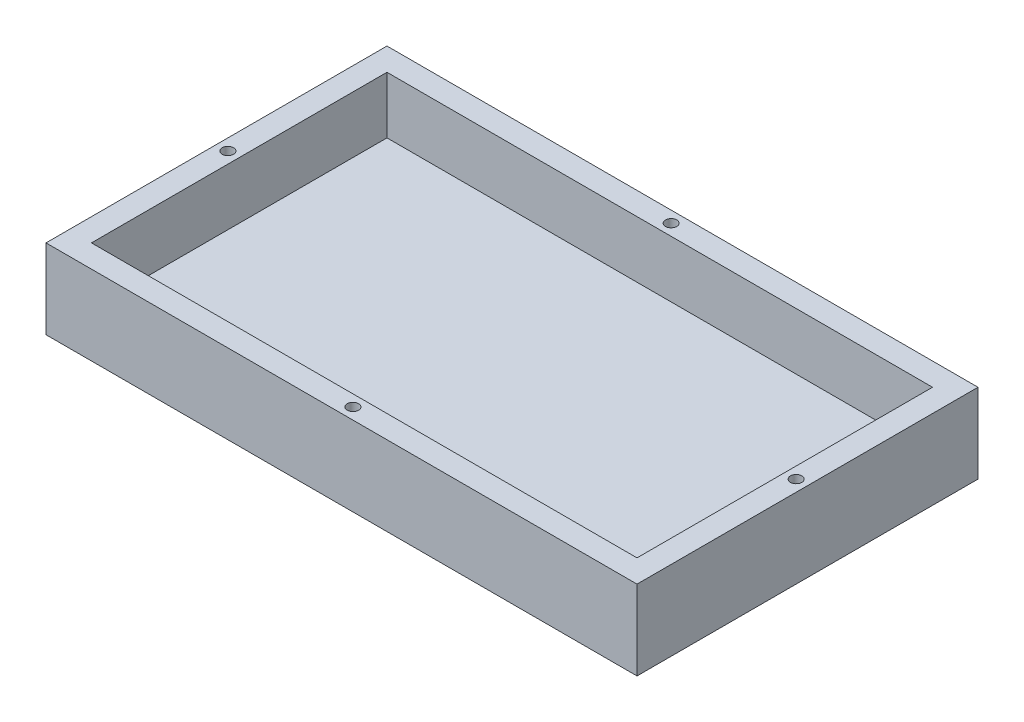
ISO-10303-21;
HEADER;
FILE_DESCRIPTION(('STEP AP214'),'2;1');
FILE_NAME('part.step','',(''),(''),'','','');
FILE_SCHEMA(('AUTOMOTIVE_DESIGN { 1 0 10303 214 1 1 1 1 }'));
ENDSEC;
DATA;
#1=APPLICATION_CONTEXT('core data for automotive mechanical design processes');
#2=APPLICATION_PROTOCOL_DEFINITION('international standard','automotive_design',2000,#1);
#3=PRODUCT_CONTEXT('',#1,'mechanical');
#4=PRODUCT('Part','Part','',(#3));
#5=PRODUCT_RELATED_PRODUCT_CATEGORY('part','',(#4));
#6=PRODUCT_DEFINITION_FORMATION('','',#4);
#7=PRODUCT_DEFINITION_CONTEXT('part definition',#1,'design');
#8=PRODUCT_DEFINITION('design','',#6,#7);
#9=PRODUCT_DEFINITION_SHAPE('','',#8);
#10=(LENGTH_UNIT() NAMED_UNIT(*) SI_UNIT(.MILLI.,.METRE.));
#11=(NAMED_UNIT(*) PLANE_ANGLE_UNIT() SI_UNIT($,.RADIAN.));
#12=(NAMED_UNIT(*) SI_UNIT($,.STERADIAN.) SOLID_ANGLE_UNIT());
#13=UNCERTAINTY_MEASURE_WITH_UNIT(LENGTH_MEASURE(1.E-05),#10,'distance_accuracy_value','');
#14=(GEOMETRIC_REPRESENTATION_CONTEXT(3) GLOBAL_UNCERTAINTY_ASSIGNED_CONTEXT((#13)) GLOBAL_UNIT_ASSIGNED_CONTEXT((#10,
#11,#12)) REPRESENTATION_CONTEXT('',''));
#15=CARTESIAN_POINT('',(0.,0.,0.));
#16=DIRECTION('',(0.,0.,1.));
#17=DIRECTION('',(1.,0.,0.));
#18=AXIS2_PLACEMENT_3D('',#15,#16,#17);
#19=CARTESIAN_POINT('',(0.,17.78,0.));
#20=DIRECTION('',(1.,0.,0.));
#21=DIRECTION('',(0.,0.,-1.));
#22=AXIS2_PLACEMENT_3D('',#19,#20,#21);
#23=PLANE('',#22);
#24=DIRECTION('',(0.,-1.,0.));
#25=VECTOR('',#24,1.);
#26=CARTESIAN_POINT('',(0.,17.78,0.));
#27=LINE('',#26,#25);
#28=CARTESIAN_POINT('',(0.,8.89,0.));
#29=VERTEX_POINT('',#28);
#30=CARTESIAN_POINT('',(0.,0.,0.));
#31=VERTEX_POINT('',#30);
#32=EDGE_CURVE('E64',#29,#31,#27,.T.);
#33=ORIENTED_EDGE('',*,*,#32,.F.);
#34=DIRECTION('',(0.,0.,-1.));
#35=VECTOR('',#34,1.);
#36=CARTESIAN_POINT('',(0.,8.89,0.));
#37=LINE('',#36,#35);
#38=CARTESIAN_POINT('',(0.,8.89,-38.1));
#39=VERTEX_POINT('',#38);
#40=EDGE_CURVE('E118',#29,#39,#37,.T.);
#41=ORIENTED_EDGE('',*,*,#40,.T.);
#42=DIRECTION('',(0.,-1.,0.));
#43=VECTOR('',#42,1.);
#44=CARTESIAN_POINT('',(0.,17.78,-38.1));
#45=LINE('',#44,#43);
#46=CARTESIAN_POINT('',(0.,0.,-38.1));
#47=VERTEX_POINT('',#46);
#48=EDGE_CURVE('E141',#39,#47,#45,.T.);
#49=ORIENTED_EDGE('',*,*,#48,.T.);
#50=DIRECTION('',(0.,0.,1.));
#51=VECTOR('',#50,1.);
#52=CARTESIAN_POINT('',(0.,0.,0.));
#53=LINE('',#52,#51);
#54=EDGE_CURVE('E136',#47,#31,#53,.T.);
#55=ORIENTED_EDGE('',*,*,#54,.T.);
#56=EDGE_LOOP('',(#33,#41,#49,#55));
#57=FACE_BOUND('',#56,.T.);
#58=ADVANCED_FACE('F57',(#57),#23,.F.);
#59=CARTESIAN_POINT('',(0.,17.78,0.));
#60=DIRECTION('',(0.,0.,-1.));
#61=DIRECTION('',(-1.,0.,0.));
#62=AXIS2_PLACEMENT_3D('',#59,#60,#61);
#63=PLANE('',#62);
#64=DIRECTION('',(0.,-1.,0.));
#65=VECTOR('',#64,1.);
#66=CARTESIAN_POINT('',(66.04,17.78,0.));
#67=LINE('',#66,#65);
#68=CARTESIAN_POINT('',(66.04,8.89,0.));
#69=VERTEX_POINT('',#68);
#70=CARTESIAN_POINT('',(66.04,0.,0.));
#71=VERTEX_POINT('',#70);
#72=EDGE_CURVE('E132',#69,#71,#67,.T.);
#73=ORIENTED_EDGE('',*,*,#72,.F.);
#74=DIRECTION('',(1.,0.,0.));
#75=VECTOR('',#74,1.);
#76=CARTESIAN_POINT('',(0.,8.89,0.));
#77=LINE('',#76,#75);
#78=EDGE_CURVE('E121',#29,#69,#77,.T.);
#79=ORIENTED_EDGE('',*,*,#78,.F.);
#80=ORIENTED_EDGE('',*,*,#32,.T.);
#81=DIRECTION('',(1.,0.,0.));
#82=VECTOR('',#81,1.);
#83=CARTESIAN_POINT('',(0.,0.,0.));
#84=LINE('',#83,#82);
#85=EDGE_CURVE('E149',#31,#71,#84,.T.);
#86=ORIENTED_EDGE('',*,*,#85,.T.);
#87=EDGE_LOOP('',(#73,#79,#80,#86));
#88=FACE_BOUND('',#87,.T.);
#89=ADVANCED_FACE('F129',(#88),#63,.F.);
#90=CARTESIAN_POINT('',(66.04,17.78,0.));
#91=DIRECTION('',(-1.,0.,0.));
#92=DIRECTION('',(0.,0.,1.));
#93=AXIS2_PLACEMENT_3D('',#90,#91,#92);
#94=PLANE('',#93);
#95=DIRECTION('',(0.,-1.,0.));
#96=VECTOR('',#95,1.);
#97=CARTESIAN_POINT('',(66.04,17.78,-38.1));
#98=LINE('',#97,#96);
#99=CARTESIAN_POINT('',(66.04,8.89,-38.1));
#100=VERTEX_POINT('',#99);
#101=CARTESIAN_POINT('',(66.04,0.,-38.1));
#102=VERTEX_POINT('',#101);
#103=EDGE_CURVE('E137',#100,#102,#98,.T.);
#104=ORIENTED_EDGE('',*,*,#103,.F.);
#105=DIRECTION('',(0.,0.,-1.));
#106=VECTOR('',#105,1.);
#107=CARTESIAN_POINT('',(66.04,8.89,0.));
#108=LINE('',#107,#106);
#109=EDGE_CURVE('E71',#69,#100,#108,.T.);
#110=ORIENTED_EDGE('',*,*,#109,.F.);
#111=ORIENTED_EDGE('',*,*,#72,.T.);
#112=DIRECTION('',(0.,0.,-1.));
#113=VECTOR('',#112,1.);
#114=CARTESIAN_POINT('',(66.04,0.,0.));
#115=LINE('',#114,#113);
#116=EDGE_CURVE('E146',#71,#102,#115,.T.);
#117=ORIENTED_EDGE('',*,*,#116,.T.);
#118=EDGE_LOOP('',(#104,#110,#111,#117));
#119=FACE_BOUND('',#118,.T.);
#120=ADVANCED_FACE('F251',(#119),#94,.F.);
#121=CARTESIAN_POINT('',(0.,17.78,-38.1));
#122=DIRECTION('',(0.,0.,1.));
#123=DIRECTION('',(1.,0.,0.));
#124=AXIS2_PLACEMENT_3D('',#121,#122,#123);
#125=PLANE('',#124);
#126=ORIENTED_EDGE('',*,*,#48,.F.);
#127=DIRECTION('',(1.,0.,0.));
#128=VECTOR('',#127,1.);
#129=CARTESIAN_POINT('',(0.,8.89,-38.1));
#130=LINE('',#129,#128);
#131=EDGE_CURVE('E122',#39,#100,#130,.T.);
#132=ORIENTED_EDGE('',*,*,#131,.T.);
#133=ORIENTED_EDGE('',*,*,#103,.T.);
#134=DIRECTION('',(-1.,0.,0.));
#135=VECTOR('',#134,1.);
#136=CARTESIAN_POINT('',(0.,0.,-38.1));
#137=LINE('',#136,#135);
#138=EDGE_CURVE('E143',#102,#47,#137,.T.);
#139=ORIENTED_EDGE('',*,*,#138,.T.);
#140=EDGE_LOOP('',(#126,#132,#133,#139));
#141=FACE_BOUND('',#140,.T.);
#142=ADVANCED_FACE('F255',(#141),#125,.F.);
#143=CARTESIAN_POINT('',(0.,0.,0.));
#144=DIRECTION('',(0.,-1.,0.));
#145=DIRECTION('',(0.,0.,-1.));
#146=AXIS2_PLACEMENT_3D('',#143,#144,#145);
#147=PLANE('',#146);
#148=ORIENTED_EDGE('',*,*,#54,.F.);
#149=ORIENTED_EDGE('',*,*,#138,.F.);
#150=ORIENTED_EDGE('',*,*,#116,.F.);
#151=ORIENTED_EDGE('',*,*,#85,.F.);
#152=EDGE_LOOP('',(#148,#149,#150,#151));
#153=FACE_BOUND('',#152,.T.);
#154=ADVANCED_FACE('F222',(#153),#147,.T.);
#155=CARTESIAN_POINT('',(0.,8.89,0.));
#156=DIRECTION('',(0.,-1.,0.));
#157=DIRECTION('',(0.,0.,-1.));
#158=AXIS2_PLACEMENT_3D('',#155,#156,#157);
#159=PLANE('',#158);
#160=CARTESIAN_POINT('',(33.02,8.89,-36.83));
#161=DIRECTION('',(0.,1.,0.));
#162=DIRECTION('',(0.,0.,1.));
#163=AXIS2_PLACEMENT_3D('',#160,#161,#162);
#164=CIRCLE('',#163,0.634999999999996);
#165=CARTESIAN_POINT('',(33.02,8.89,-36.195));
#166=VERTEX_POINT('',#165);
#167=EDGE_CURVE('E204',#166,#166,#164,.T.);
#168=ORIENTED_EDGE('',*,*,#167,.F.);
#169=EDGE_LOOP('',(#168));
#170=FACE_BOUND('',#169,.T.);
#171=CARTESIAN_POINT('',(33.02,8.89,-1.27));
#172=DIRECTION('',(0.,1.,0.));
#173=DIRECTION('',(0.,0.,1.));
#174=AXIS2_PLACEMENT_3D('',#171,#172,#173);
#175=CIRCLE('',#174,0.634999999999995);
#176=CARTESIAN_POINT('',(33.02,8.89,-0.635000000000005));
#177=VERTEX_POINT('',#176);
#178=EDGE_CURVE('E198',#177,#177,#175,.T.);
#179=ORIENTED_EDGE('',*,*,#178,.F.);
#180=EDGE_LOOP('',(#179));
#181=FACE_BOUND('',#180,.T.);
#182=CARTESIAN_POINT('',(1.27,8.89,-19.05));
#183=DIRECTION('',(0.,1.,0.));
#184=DIRECTION('',(0.,0.,1.));
#185=AXIS2_PLACEMENT_3D('',#182,#183,#184);
#186=CIRCLE('',#185,0.634999999999999);
#187=CARTESIAN_POINT('',(1.27,8.89,-18.415));
#188=VERTEX_POINT('',#187);
#189=EDGE_CURVE('E192',#188,#188,#186,.T.);
#190=ORIENTED_EDGE('',*,*,#189,.F.);
#191=EDGE_LOOP('',(#190));
#192=FACE_BOUND('',#191,.T.);
#193=CARTESIAN_POINT('',(64.77,8.89,-19.05));
#194=DIRECTION('',(0.,1.,0.));
#195=DIRECTION('',(0.,0.,1.));
#196=AXIS2_PLACEMENT_3D('',#193,#194,#195);
#197=CIRCLE('',#196,0.635000000000002);
#198=CARTESIAN_POINT('',(64.77,8.89,-18.415));
#199=VERTEX_POINT('',#198);
#200=EDGE_CURVE('E186',#199,#199,#197,.T.);
#201=ORIENTED_EDGE('',*,*,#200,.F.);
#202=EDGE_LOOP('',(#201));
#203=FACE_BOUND('',#202,.T.);
#204=ORIENTED_EDGE('',*,*,#109,.T.);
#205=ORIENTED_EDGE('',*,*,#131,.F.);
#206=ORIENTED_EDGE('',*,*,#40,.F.);
#207=ORIENTED_EDGE('',*,*,#78,.T.);
#208=EDGE_LOOP('',(#204,#205,#206,#207));
#209=FACE_BOUND('',#208,.T.);
#210=DIRECTION('',(-1.,0.,0.));
#211=VECTOR('',#210,1.);
#212=CARTESIAN_POINT('',(2.54,8.89,-35.56));
#213=LINE('',#212,#211);
#214=CARTESIAN_POINT('',(63.5,8.89,-35.56));
#215=VERTEX_POINT('',#214);
#216=CARTESIAN_POINT('',(2.54,8.89,-35.56));
#217=VERTEX_POINT('',#216);
#218=EDGE_CURVE('E179',#215,#217,#213,.T.);
#219=ORIENTED_EDGE('',*,*,#218,.F.);
#220=DIRECTION('',(0.,0.,-1.));
#221=VECTOR('',#220,1.);
#222=CARTESIAN_POINT('',(63.5,8.89,-35.56));
#223=LINE('',#222,#221);
#224=CARTESIAN_POINT('',(63.5,8.89,-2.54));
#225=VERTEX_POINT('',#224);
#226=EDGE_CURVE('E79',#225,#215,#223,.T.);
#227=ORIENTED_EDGE('',*,*,#226,.F.);
#228=DIRECTION('',(1.,0.,0.));
#229=VECTOR('',#228,1.);
#230=CARTESIAN_POINT('',(2.54,8.89,-2.54));
#231=LINE('',#230,#229);
#232=CARTESIAN_POINT('',(2.54,8.89,-2.54));
#233=VERTEX_POINT('',#232);
#234=EDGE_CURVE('E12',#233,#225,#231,.T.);
#235=ORIENTED_EDGE('',*,*,#234,.F.);
#236=DIRECTION('',(0.,0.,1.));
#237=VECTOR('',#236,1.);
#238=CARTESIAN_POINT('',(2.54,8.89,-35.56));
#239=LINE('',#238,#237);
#240=EDGE_CURVE('E176',#217,#233,#239,.T.);
#241=ORIENTED_EDGE('',*,*,#240,.F.);
#242=EDGE_LOOP('',(#219,#227,#235,#241));
#243=FACE_BOUND('',#242,.T.);
#244=ADVANCED_FACE('F120',(#170,#181,#192,#203,#209,#243),#159,.F.);
#245=CARTESIAN_POINT('',(0.,2.54,0.));
#246=DIRECTION('',(0.,1.,0.));
#247=DIRECTION('',(0.,0.,1.));
#248=AXIS2_PLACEMENT_3D('',#245,#246,#247);
#249=PLANE('',#248);
#250=DIRECTION('',(0.,0.,1.));
#251=VECTOR('',#250,1.);
#252=CARTESIAN_POINT('',(2.54,2.54,-35.56));
#253=LINE('',#252,#251);
#254=CARTESIAN_POINT('',(2.54,2.54,-35.56));
#255=VERTEX_POINT('',#254);
#256=CARTESIAN_POINT('',(2.54,2.54,-2.54));
#257=VERTEX_POINT('',#256);
#258=EDGE_CURVE('E173',#255,#257,#253,.T.);
#259=ORIENTED_EDGE('',*,*,#258,.T.);
#260=DIRECTION('',(1.,0.,0.));
#261=VECTOR('',#260,1.);
#262=CARTESIAN_POINT('',(2.54,2.54,-2.54));
#263=LINE('',#262,#261);
#264=CARTESIAN_POINT('',(63.5,2.54,-2.54));
#265=VERTEX_POINT('',#264);
#266=EDGE_CURVE('E170',#257,#265,#263,.T.);
#267=ORIENTED_EDGE('',*,*,#266,.T.);
#268=DIRECTION('',(0.,0.,-1.));
#269=VECTOR('',#268,1.);
#270=CARTESIAN_POINT('',(63.5,2.54,-35.56));
#271=LINE('',#270,#269);
#272=CARTESIAN_POINT('',(63.5,2.54,-35.56));
#273=VERTEX_POINT('',#272);
#274=EDGE_CURVE('E167',#265,#273,#271,.T.);
#275=ORIENTED_EDGE('',*,*,#274,.T.);
#276=DIRECTION('',(-1.,0.,0.));
#277=VECTOR('',#276,1.);
#278=CARTESIAN_POINT('',(2.54,2.54,-35.56));
#279=LINE('',#278,#277);
#280=EDGE_CURVE('E157',#273,#255,#279,.T.);
#281=ORIENTED_EDGE('',*,*,#280,.T.);
#282=EDGE_LOOP('',(#259,#267,#275,#281));
#283=FACE_BOUND('',#282,.T.);
#284=ADVANCED_FACE('F221',(#283),#249,.T.);
#285=CARTESIAN_POINT('',(2.54,2.54,-2.54));
#286=DIRECTION('',(0.,0.,1.));
#287=DIRECTION('',(1.,0.,0.));
#288=AXIS2_PLACEMENT_3D('',#285,#286,#287);
#289=PLANE('',#288);
#290=DIRECTION('',(0.,1.,0.));
#291=VECTOR('',#290,1.);
#292=CARTESIAN_POINT('',(2.54,2.54,-2.54));
#293=LINE('',#292,#291);
#294=EDGE_CURVE('E153',#257,#233,#293,.T.);
#295=ORIENTED_EDGE('',*,*,#294,.T.);
#296=ORIENTED_EDGE('',*,*,#234,.T.);
#297=DIRECTION('',(0.,1.,0.));
#298=VECTOR('',#297,1.);
#299=CARTESIAN_POINT('',(63.5,2.54,-2.54));
#300=LINE('',#299,#298);
#301=EDGE_CURVE('E156',#265,#225,#300,.T.);
#302=ORIENTED_EDGE('',*,*,#301,.F.);
#303=ORIENTED_EDGE('',*,*,#266,.F.);
#304=EDGE_LOOP('',(#295,#296,#302,#303));
#305=FACE_BOUND('',#304,.T.);
#306=ADVANCED_FACE('F265',(#305),#289,.F.);
#307=CARTESIAN_POINT('',(63.5,2.54,-35.56));
#308=DIRECTION('',(1.,0.,0.));
#309=DIRECTION('',(0.,0.,-1.));
#310=AXIS2_PLACEMENT_3D('',#307,#308,#309);
#311=PLANE('',#310);
#312=ORIENTED_EDGE('',*,*,#301,.T.);
#313=ORIENTED_EDGE('',*,*,#226,.T.);
#314=DIRECTION('',(0.,1.,0.));
#315=VECTOR('',#314,1.);
#316=CARTESIAN_POINT('',(63.5,2.54,-35.56));
#317=LINE('',#316,#315);
#318=EDGE_CURVE('E160',#273,#215,#317,.T.);
#319=ORIENTED_EDGE('',*,*,#318,.F.);
#320=ORIENTED_EDGE('',*,*,#274,.F.);
#321=EDGE_LOOP('',(#312,#313,#319,#320));
#322=FACE_BOUND('',#321,.T.);
#323=ADVANCED_FACE('F268',(#322),#311,.F.);
#324=CARTESIAN_POINT('',(2.54,2.54,-35.56));
#325=DIRECTION('',(0.,0.,-1.));
#326=DIRECTION('',(-1.,0.,0.));
#327=AXIS2_PLACEMENT_3D('',#324,#325,#326);
#328=PLANE('',#327);
#329=ORIENTED_EDGE('',*,*,#318,.T.);
#330=ORIENTED_EDGE('',*,*,#218,.T.);
#331=DIRECTION('',(0.,1.,0.));
#332=VECTOR('',#331,1.);
#333=CARTESIAN_POINT('',(2.54,2.54,-35.56));
#334=LINE('',#333,#332);
#335=EDGE_CURVE('E152',#255,#217,#334,.T.);
#336=ORIENTED_EDGE('',*,*,#335,.F.);
#337=ORIENTED_EDGE('',*,*,#280,.F.);
#338=EDGE_LOOP('',(#329,#330,#336,#337));
#339=FACE_BOUND('',#338,.T.);
#340=ADVANCED_FACE('F243',(#339),#328,.F.);
#341=CARTESIAN_POINT('',(2.54,2.54,-35.56));
#342=DIRECTION('',(-1.,0.,0.));
#343=DIRECTION('',(0.,0.,1.));
#344=AXIS2_PLACEMENT_3D('',#341,#342,#343);
#345=PLANE('',#344);
#346=ORIENTED_EDGE('',*,*,#335,.T.);
#347=ORIENTED_EDGE('',*,*,#240,.T.);
#348=ORIENTED_EDGE('',*,*,#294,.F.);
#349=ORIENTED_EDGE('',*,*,#258,.F.);
#350=EDGE_LOOP('',(#346,#347,#348,#349));
#351=FACE_BOUND('',#350,.T.);
#352=ADVANCED_FACE('F233',(#351),#345,.F.);
#353=CARTESIAN_POINT('',(64.77,3.81,-19.05));
#354=DIRECTION('',(0.,1.,0.));
#355=DIRECTION('',(0.,0.,1.));
#356=AXIS2_PLACEMENT_3D('',#353,#354,#355);
#357=CYLINDRICAL_SURFACE('',#356,0.635000000000002);
#358=CARTESIAN_POINT('',(64.77,3.81,-19.05));
#359=DIRECTION('',(0.,1.,0.));
#360=DIRECTION('',(0.,0.,1.));
#361=AXIS2_PLACEMENT_3D('',#358,#359,#360);
#362=CIRCLE('',#361,0.635000000000002);
#363=CARTESIAN_POINT('',(64.77,3.81,-18.415));
#364=VERTEX_POINT('',#363);
#365=EDGE_CURVE('E189',#364,#364,#362,.T.);
#366=ORIENTED_EDGE('',*,*,#365,.F.);
#367=EDGE_LOOP('',(#366));
#368=FACE_BOUND('',#367,.T.);
#369=ORIENTED_EDGE('',*,*,#200,.T.);
#370=EDGE_LOOP('',(#369));
#371=FACE_BOUND('',#370,.T.);
#372=ADVANCED_FACE('F230',(#368,#371),#357,.F.);
#373=CARTESIAN_POINT('',(64.77,3.81,-19.05));
#374=DIRECTION('',(0.,1.,0.));
#375=DIRECTION('',(0.,0.,1.));
#376=AXIS2_PLACEMENT_3D('',#373,#374,#375);
#377=PLANE('',#376);
#378=ORIENTED_EDGE('',*,*,#365,.T.);
#379=EDGE_LOOP('',(#378));
#380=FACE_BOUND('',#379,.T.);
#381=ADVANCED_FACE('F232',(#380),#377,.T.);
#382=CARTESIAN_POINT('',(1.27,3.81,-19.05));
#383=DIRECTION('',(0.,1.,0.));
#384=DIRECTION('',(0.,0.,1.));
#385=AXIS2_PLACEMENT_3D('',#382,#383,#384);
#386=CYLINDRICAL_SURFACE('',#385,0.634999999999999);
#387=CARTESIAN_POINT('',(1.27,3.81,-19.05));
#388=DIRECTION('',(0.,1.,0.));
#389=DIRECTION('',(0.,0.,1.));
#390=AXIS2_PLACEMENT_3D('',#387,#388,#389);
#391=CIRCLE('',#390,0.634999999999999);
#392=CARTESIAN_POINT('',(1.27,3.81,-18.415));
#393=VERTEX_POINT('',#392);
#394=EDGE_CURVE('E195',#393,#393,#391,.T.);
#395=ORIENTED_EDGE('',*,*,#394,.F.);
#396=EDGE_LOOP('',(#395));
#397=FACE_BOUND('',#396,.T.);
#398=ORIENTED_EDGE('',*,*,#189,.T.);
#399=EDGE_LOOP('',(#398));
#400=FACE_BOUND('',#399,.T.);
#401=ADVANCED_FACE('F240',(#397,#400),#386,.F.);
#402=CARTESIAN_POINT('',(1.27,3.81,-19.05));
#403=DIRECTION('',(0.,1.,0.));
#404=DIRECTION('',(0.,0.,1.));
#405=AXIS2_PLACEMENT_3D('',#402,#403,#404);
#406=PLANE('',#405);
#407=ORIENTED_EDGE('',*,*,#394,.T.);
#408=EDGE_LOOP('',(#407));
#409=FACE_BOUND('',#408,.T.);
#410=ADVANCED_FACE('F326',(#409),#406,.T.);
#411=CARTESIAN_POINT('',(33.02,3.81,-1.27));
#412=DIRECTION('',(0.,1.,0.));
#413=DIRECTION('',(0.,0.,1.));
#414=AXIS2_PLACEMENT_3D('',#411,#412,#413);
#415=CYLINDRICAL_SURFACE('',#414,0.634999999999995);
#416=CARTESIAN_POINT('',(33.02,3.81,-1.27));
#417=DIRECTION('',(0.,1.,0.));
#418=DIRECTION('',(0.,0.,1.));
#419=AXIS2_PLACEMENT_3D('',#416,#417,#418);
#420=CIRCLE('',#419,0.634999999999995);
#421=CARTESIAN_POINT('',(33.02,3.81,-0.635000000000005));
#422=VERTEX_POINT('',#421);
#423=EDGE_CURVE('E201',#422,#422,#420,.T.);
#424=ORIENTED_EDGE('',*,*,#423,.F.);
#425=EDGE_LOOP('',(#424));
#426=FACE_BOUND('',#425,.T.);
#427=ORIENTED_EDGE('',*,*,#178,.T.);
#428=EDGE_LOOP('',(#427));
#429=FACE_BOUND('',#428,.T.);
#430=ADVANCED_FACE('F336',(#426,#429),#415,.F.);
#431=CARTESIAN_POINT('',(33.02,3.81,-1.27));
#432=DIRECTION('',(0.,1.,0.));
#433=DIRECTION('',(0.,0.,1.));
#434=AXIS2_PLACEMENT_3D('',#431,#432,#433);
#435=PLANE('',#434);
#436=ORIENTED_EDGE('',*,*,#423,.T.);
#437=EDGE_LOOP('',(#436));
#438=FACE_BOUND('',#437,.T.);
#439=ADVANCED_FACE('F215',(#438),#435,.T.);
#440=CARTESIAN_POINT('',(33.02,3.81,-36.83));
#441=DIRECTION('',(0.,1.,0.));
#442=DIRECTION('',(0.,0.,1.));
#443=AXIS2_PLACEMENT_3D('',#440,#441,#442);
#444=CYLINDRICAL_SURFACE('',#443,0.634999999999996);
#445=CARTESIAN_POINT('',(33.02,3.81,-36.83));
#446=DIRECTION('',(0.,1.,0.));
#447=DIRECTION('',(0.,0.,1.));
#448=AXIS2_PLACEMENT_3D('',#445,#446,#447);
#449=CIRCLE('',#448,0.634999999999996);
#450=CARTESIAN_POINT('',(33.02,3.81,-36.195));
#451=VERTEX_POINT('',#450);
#452=EDGE_CURVE('E184',#451,#451,#449,.T.);
#453=ORIENTED_EDGE('',*,*,#452,.F.);
#454=EDGE_LOOP('',(#453));
#455=FACE_BOUND('',#454,.T.);
#456=ORIENTED_EDGE('',*,*,#167,.T.);
#457=EDGE_LOOP('',(#456));
#458=FACE_BOUND('',#457,.T.);
#459=ADVANCED_FACE('F212',(#455,#458),#444,.F.);
#460=CARTESIAN_POINT('',(33.02,3.81,-36.83));
#461=DIRECTION('',(0.,1.,0.));
#462=DIRECTION('',(0.,0.,1.));
#463=AXIS2_PLACEMENT_3D('',#460,#461,#462);
#464=PLANE('',#463);
#465=ORIENTED_EDGE('',*,*,#452,.T.);
#466=EDGE_LOOP('',(#465));
#467=FACE_BOUND('',#466,.T.);
#468=ADVANCED_FACE('F210',(#467),#464,.T.);
#469=CLOSED_SHELL('',(#58,#89,#120,#142,#154,#244,#284,#306,#323,#340,#352,#372,#381,#401,#410,
#430,#439,#459,#468));
#470=MANIFOLD_SOLID_BREP('B2',#469);
#471=ADVANCED_BREP_SHAPE_REPRESENTATION('',(#18,#470),#14);
#472=SHAPE_DEFINITION_REPRESENTATION(#9,#471);
ENDSEC;
END-ISO-10303-21;
